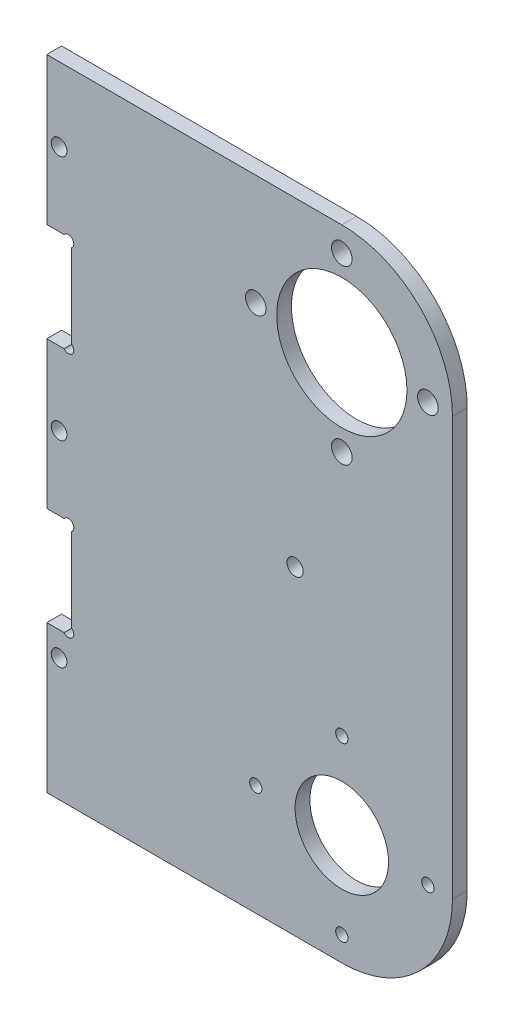
ISO-10303-21;
HEADER;
FILE_DESCRIPTION(('STEP AP214'),'2;1');
FILE_NAME('part.step','',(''),(''),'','','');
FILE_SCHEMA(('AUTOMOTIVE_DESIGN { 1 0 10303 214 1 1 1 1 }'));
ENDSEC;
DATA;
#1=APPLICATION_CONTEXT('core data for automotive mechanical design processes');
#2=APPLICATION_PROTOCOL_DEFINITION('international standard','automotive_design',2000,#1);
#3=PRODUCT_CONTEXT('',#1,'mechanical');
#4=PRODUCT('Part','Part','',(#3));
#5=PRODUCT_RELATED_PRODUCT_CATEGORY('part','',(#4));
#6=PRODUCT_DEFINITION_FORMATION('','',#4);
#7=PRODUCT_DEFINITION_CONTEXT('part definition',#1,'design');
#8=PRODUCT_DEFINITION('design','',#6,#7);
#9=PRODUCT_DEFINITION_SHAPE('','',#8);
#10=(LENGTH_UNIT() NAMED_UNIT(*) SI_UNIT(.MILLI.,.METRE.));
#11=(NAMED_UNIT(*) PLANE_ANGLE_UNIT() SI_UNIT($,.RADIAN.));
#12=(NAMED_UNIT(*) SI_UNIT($,.STERADIAN.) SOLID_ANGLE_UNIT());
#13=UNCERTAINTY_MEASURE_WITH_UNIT(LENGTH_MEASURE(1.E-05),#10,'distance_accuracy_value','');
#14=(GEOMETRIC_REPRESENTATION_CONTEXT(3) GLOBAL_UNCERTAINTY_ASSIGNED_CONTEXT((#13)) GLOBAL_UNIT_ASSIGNED_CONTEXT((#10,
#11,#12)) REPRESENTATION_CONTEXT('',''));
#15=CARTESIAN_POINT('',(0.,0.,0.));
#16=DIRECTION('',(0.,0.,1.));
#17=DIRECTION('',(1.,0.,0.));
#18=AXIS2_PLACEMENT_3D('',#15,#16,#17);
#19=CARTESIAN_POINT('',(-60.,0.,3.));
#20=DIRECTION('',(1.,0.,0.));
#21=DIRECTION('',(0.,1.,0.));
#22=AXIS2_PLACEMENT_3D('',#19,#20,#21);
#23=PLANE('',#22);
#24=DIRECTION('',(0.,0.,1.));
#25=VECTOR('',#24,1.);
#26=CARTESIAN_POINT('',(-60.,27.55,-7.));
#27=LINE('',#26,#25);
#28=CARTESIAN_POINT('',(-60.,27.55,0.));
#29=VERTEX_POINT('',#28);
#30=CARTESIAN_POINT('',(-60.,27.55,3.));
#31=VERTEX_POINT('',#30);
#32=EDGE_CURVE('E140',#29,#31,#27,.T.);
#33=ORIENTED_EDGE('',*,*,#32,.T.);
#34=DIRECTION('',(0.,-1.,0.));
#35=VECTOR('',#34,1.);
#36=CARTESIAN_POINT('',(-60.,0.,3.));
#37=LINE('',#36,#35);
#38=CARTESIAN_POINT('',(-60.,57.45,3.));
#39=VERTEX_POINT('',#38);
#40=EDGE_CURVE('E328',#39,#31,#37,.T.);
#41=ORIENTED_EDGE('',*,*,#40,.F.);
#42=DIRECTION('',(0.,0.,1.));
#43=VECTOR('',#42,1.);
#44=CARTESIAN_POINT('',(-60.,57.45,-7.));
#45=LINE('',#44,#43);
#46=CARTESIAN_POINT('',(-60.,57.45,0.));
#47=VERTEX_POINT('',#46);
#48=EDGE_CURVE('E301',#47,#39,#45,.T.);
#49=ORIENTED_EDGE('',*,*,#48,.F.);
#50=DIRECTION('',(0.,-1.,0.));
#51=VECTOR('',#50,1.);
#52=CARTESIAN_POINT('',(-60.,0.,0.));
#53=LINE('',#52,#51);
#54=EDGE_CURVE('E377',#47,#29,#53,.T.);
#55=ORIENTED_EDGE('',*,*,#54,.T.);
#56=EDGE_LOOP('',(#33,#41,#49,#55));
#57=FACE_BOUND('',#56,.T.);
#58=ADVANCED_FACE('F115',(#57),#23,.F.);
#59=DIRECTION('',(0.,0.,1.));
#60=VECTOR('',#59,1.);
#61=CARTESIAN_POINT('',(-60.,77.55,-7.));
#62=LINE('',#61,#60);
#63=CARTESIAN_POINT('',(-60.,77.55,0.));
#64=VERTEX_POINT('',#63);
#65=CARTESIAN_POINT('',(-60.,77.55,3.));
#66=VERTEX_POINT('',#65);
#67=EDGE_CURVE('E298',#64,#66,#62,.T.);
#68=ORIENTED_EDGE('',*,*,#67,.T.);
#69=CARTESIAN_POINT('',(-60.,107.5,3.));
#70=VERTEX_POINT('',#69);
#71=EDGE_CURVE('E324',#70,#66,#37,.T.);
#72=ORIENTED_EDGE('',*,*,#71,.F.);
#73=DIRECTION('',(0.,0.,-1.));
#74=VECTOR('',#73,1.);
#75=CARTESIAN_POINT('',(-60.,107.5,3.));
#76=LINE('',#75,#74);
#77=CARTESIAN_POINT('',(-60.,107.5,0.));
#78=VERTEX_POINT('',#77);
#79=EDGE_CURVE('E423',#70,#78,#76,.T.);
#80=ORIENTED_EDGE('',*,*,#79,.T.);
#81=EDGE_CURVE('E373',#78,#64,#53,.T.);
#82=ORIENTED_EDGE('',*,*,#81,.T.);
#83=EDGE_LOOP('',(#68,#72,#80,#82));
#84=FACE_BOUND('',#83,.T.);
#85=ADVANCED_FACE('F474',(#84),#23,.F.);
#86=CARTESIAN_POINT('',(0.,85.,3.));
#87=DIRECTION('',(0.,0.,-1.));
#88=DIRECTION('',(-1.,0.,0.));
#89=AXIS2_PLACEMENT_3D('',#86,#87,#88);
#90=CYLINDRICAL_SURFACE('',#89,22.5);
#91=CARTESIAN_POINT('',(0.,85.,0.));
#92=DIRECTION('',(0.,0.,1.));
#93=DIRECTION('',(1.,0.,0.));
#94=AXIS2_PLACEMENT_3D('',#91,#92,#93);
#95=CIRCLE('',#94,22.5);
#96=CARTESIAN_POINT('',(0.,107.5,0.));
#97=VERTEX_POINT('',#96);
#98=CARTESIAN_POINT('',(22.5,85.,0.));
#99=VERTEX_POINT('',#98);
#100=EDGE_CURVE('E365',#97,#99,#95,.F.);
#101=ORIENTED_EDGE('',*,*,#100,.F.);
#102=DIRECTION('',(0.,0.,-1.));
#103=VECTOR('',#102,1.);
#104=CARTESIAN_POINT('',(0.,107.5,3.));
#105=LINE('',#104,#103);
#106=CARTESIAN_POINT('',(0.,107.5,3.));
#107=VERTEX_POINT('',#106);
#108=EDGE_CURVE('E425',#107,#97,#105,.T.);
#109=ORIENTED_EDGE('',*,*,#108,.F.);
#110=CARTESIAN_POINT('',(0.,85.,3.));
#111=DIRECTION('',(0.,0.,1.));
#112=DIRECTION('',(1.,0.,0.));
#113=AXIS2_PLACEMENT_3D('',#110,#111,#112);
#114=CIRCLE('',#113,22.5);
#115=CARTESIAN_POINT('',(22.5,85.,3.));
#116=VERTEX_POINT('',#115);
#117=EDGE_CURVE('E316',#107,#116,#114,.F.);
#118=ORIENTED_EDGE('',*,*,#117,.T.);
#119=DIRECTION('',(0.,0.,-1.));
#120=VECTOR('',#119,1.);
#121=CARTESIAN_POINT('',(22.5,85.,3.));
#122=LINE('',#121,#120);
#123=EDGE_CURVE('E364',#116,#99,#122,.T.);
#124=ORIENTED_EDGE('',*,*,#123,.T.);
#125=EDGE_LOOP('',(#101,#109,#118,#124));
#126=FACE_BOUND('',#125,.T.);
#127=ADVANCED_FACE('F117',(#126),#90,.T.);
#128=CARTESIAN_POINT('',(0.,107.5,3.));
#129=DIRECTION('',(0.,1.,0.));
#130=DIRECTION('',(0.,0.,1.));
#131=AXIS2_PLACEMENT_3D('',#128,#129,#130);
#132=PLANE('',#131);
#133=DIRECTION('',(1.,0.,0.));
#134=VECTOR('',#133,1.);
#135=CARTESIAN_POINT('',(0.,107.5,0.));
#136=LINE('',#135,#134);
#137=EDGE_CURVE('E368',#78,#97,#136,.T.);
#138=ORIENTED_EDGE('',*,*,#137,.F.);
#139=ORIENTED_EDGE('',*,*,#79,.F.);
#140=DIRECTION('',(1.,0.,0.));
#141=VECTOR('',#140,1.);
#142=CARTESIAN_POINT('',(0.,107.5,3.));
#143=LINE('',#142,#141);
#144=EDGE_CURVE('E319',#70,#107,#143,.T.);
#145=ORIENTED_EDGE('',*,*,#144,.T.);
#146=ORIENTED_EDGE('',*,*,#108,.T.);
#147=EDGE_LOOP('',(#138,#139,#145,#146));
#148=FACE_BOUND('',#147,.T.);
#149=ADVANCED_FACE('F486',(#148),#132,.T.);
#150=CARTESIAN_POINT('',(-60.,7.44999999999999,3.));
#151=VERTEX_POINT('',#150);
#152=CARTESIAN_POINT('',(-60.,-22.5,3.));
#153=VERTEX_POINT('',#152);
#154=EDGE_CURVE('E323',#151,#153,#37,.T.);
#155=ORIENTED_EDGE('',*,*,#154,.F.);
#156=DIRECTION('',(0.,0.,1.));
#157=VECTOR('',#156,1.);
#158=CARTESIAN_POINT('',(-60.,7.44999999999999,-7.));
#159=LINE('',#158,#157);
#160=CARTESIAN_POINT('',(-60.,7.44999999999999,0.));
#161=VERTEX_POINT('',#160);
#162=EDGE_CURVE('E251',#161,#151,#159,.T.);
#163=ORIENTED_EDGE('',*,*,#162,.F.);
#164=CARTESIAN_POINT('',(-60.,-22.5,0.));
#165=VERTEX_POINT('',#164);
#166=EDGE_CURVE('E372',#161,#165,#53,.T.);
#167=ORIENTED_EDGE('',*,*,#166,.T.);
#168=DIRECTION('',(0.,0.,-1.));
#169=VECTOR('',#168,1.);
#170=CARTESIAN_POINT('',(-60.,-22.5,3.));
#171=LINE('',#170,#169);
#172=EDGE_CURVE('E420',#153,#165,#171,.T.);
#173=ORIENTED_EDGE('',*,*,#172,.F.);
#174=EDGE_LOOP('',(#155,#163,#167,#173));
#175=FACE_BOUND('',#174,.T.);
#176=ADVANCED_FACE('F477',(#175),#23,.F.);
#177=CARTESIAN_POINT('',(0.,-22.5,3.));
#178=DIRECTION('',(0.,1.,0.));
#179=DIRECTION('',(0.,0.,1.));
#180=AXIS2_PLACEMENT_3D('',#177,#178,#179);
#181=PLANE('',#180);
#182=DIRECTION('',(1.,0.,0.));
#183=VECTOR('',#182,1.);
#184=CARTESIAN_POINT('',(0.,-22.5,0.));
#185=LINE('',#184,#183);
#186=CARTESIAN_POINT('',(0.,-22.5,0.));
#187=VERTEX_POINT('',#186);
#188=EDGE_CURVE('E376',#165,#187,#185,.T.);
#189=ORIENTED_EDGE('',*,*,#188,.T.);
#190=DIRECTION('',(0.,0.,-1.));
#191=VECTOR('',#190,1.);
#192=CARTESIAN_POINT('',(0.,-22.5,3.));
#193=LINE('',#192,#191);
#194=CARTESIAN_POINT('',(0.,-22.5,3.));
#195=VERTEX_POINT('',#194);
#196=EDGE_CURVE('E417',#195,#187,#193,.T.);
#197=ORIENTED_EDGE('',*,*,#196,.F.);
#198=DIRECTION('',(1.,0.,0.));
#199=VECTOR('',#198,1.);
#200=CARTESIAN_POINT('',(0.,-22.5,3.));
#201=LINE('',#200,#199);
#202=EDGE_CURVE('E327',#153,#195,#201,.T.);
#203=ORIENTED_EDGE('',*,*,#202,.F.);
#204=ORIENTED_EDGE('',*,*,#172,.T.);
#205=EDGE_LOOP('',(#189,#197,#203,#204));
#206=FACE_BOUND('',#205,.T.);
#207=ADVANCED_FACE('F485',(#206),#181,.F.);
#208=CARTESIAN_POINT('',(0.,0.,3.));
#209=DIRECTION('',(0.,0.,-1.));
#210=DIRECTION('',(-1.,0.,0.));
#211=AXIS2_PLACEMENT_3D('',#208,#209,#210);
#212=CYLINDRICAL_SURFACE('',#211,22.5);
#213=CARTESIAN_POINT('',(0.,0.,0.));
#214=DIRECTION('',(0.,0.,1.));
#215=DIRECTION('',(1.,0.,0.));
#216=AXIS2_PLACEMENT_3D('',#213,#214,#215);
#217=CIRCLE('',#216,22.5);
#218=CARTESIAN_POINT('',(22.5,0.,0.));
#219=VERTEX_POINT('',#218);
#220=EDGE_CURVE('E379',#187,#219,#217,.T.);
#221=ORIENTED_EDGE('',*,*,#220,.T.);
#222=DIRECTION('',(0.,0.,-1.));
#223=VECTOR('',#222,1.);
#224=CARTESIAN_POINT('',(22.5,0.,3.));
#225=LINE('',#224,#223);
#226=CARTESIAN_POINT('',(22.5,0.,3.));
#227=VERTEX_POINT('',#226);
#228=EDGE_CURVE('E414',#227,#219,#225,.T.);
#229=ORIENTED_EDGE('',*,*,#228,.F.);
#230=CARTESIAN_POINT('',(0.,0.,3.));
#231=DIRECTION('',(0.,0.,1.));
#232=DIRECTION('',(1.,0.,0.));
#233=AXIS2_PLACEMENT_3D('',#230,#231,#232);
#234=CIRCLE('',#233,22.5);
#235=EDGE_CURVE('E330',#195,#227,#234,.T.);
#236=ORIENTED_EDGE('',*,*,#235,.F.);
#237=ORIENTED_EDGE('',*,*,#196,.T.);
#238=EDGE_LOOP('',(#221,#229,#236,#237));
#239=FACE_BOUND('',#238,.T.);
#240=ADVANCED_FACE('F492',(#239),#212,.T.);
#241=CARTESIAN_POINT('',(0.,17.5,3.));
#242=DIRECTION('',(0.,0.,-1.));
#243=DIRECTION('',(-1.,0.,0.));
#244=AXIS2_PLACEMENT_3D('',#241,#242,#243);
#245=CYLINDRICAL_SURFACE('',#244,1.25);
#246=CARTESIAN_POINT('',(0.,17.5,3.));
#247=DIRECTION('',(0.,0.,1.));
#248=DIRECTION('',(1.,0.,0.));
#249=AXIS2_PLACEMENT_3D('',#246,#247,#248);
#250=CIRCLE('',#249,1.25);
#251=CARTESIAN_POINT('',(1.25000000000005,17.5,3.));
#252=VERTEX_POINT('',#251);
#253=EDGE_CURVE('E358',#252,#252,#250,.T.);
#254=ORIENTED_EDGE('',*,*,#253,.T.);
#255=EDGE_LOOP('',(#254));
#256=FACE_BOUND('',#255,.T.);
#257=CARTESIAN_POINT('',(0.,17.5,0.));
#258=DIRECTION('',(0.,0.,1.));
#259=DIRECTION('',(1.,0.,0.));
#260=AXIS2_PLACEMENT_3D('',#257,#258,#259);
#261=CIRCLE('',#260,1.25);
#262=CARTESIAN_POINT('',(1.25000000000005,17.5,0.));
#263=VERTEX_POINT('',#262);
#264=EDGE_CURVE('E408',#263,#263,#261,.T.);
#265=ORIENTED_EDGE('',*,*,#264,.F.);
#266=EDGE_LOOP('',(#265));
#267=FACE_BOUND('',#266,.T.);
#268=ADVANCED_FACE('F562',(#256,#267),#245,.F.);
#269=CARTESIAN_POINT('',(17.5,0.,3.));
#270=DIRECTION('',(0.,0.,-1.));
#271=DIRECTION('',(-1.,0.,0.));
#272=AXIS2_PLACEMENT_3D('',#269,#270,#271);
#273=CYLINDRICAL_SURFACE('',#272,1.25);
#274=CARTESIAN_POINT('',(17.5,0.,3.));
#275=DIRECTION('',(0.,0.,1.));
#276=DIRECTION('',(1.,0.,0.));
#277=AXIS2_PLACEMENT_3D('',#274,#275,#276);
#278=CIRCLE('',#277,1.25);
#279=CARTESIAN_POINT('',(18.75,0.,3.));
#280=VERTEX_POINT('',#279);
#281=EDGE_CURVE('E355',#280,#280,#278,.T.);
#282=ORIENTED_EDGE('',*,*,#281,.T.);
#283=EDGE_LOOP('',(#282));
#284=FACE_BOUND('',#283,.T.);
#285=CARTESIAN_POINT('',(17.5,0.,0.));
#286=DIRECTION('',(0.,0.,1.));
#287=DIRECTION('',(1.,0.,0.));
#288=AXIS2_PLACEMENT_3D('',#285,#286,#287);
#289=CIRCLE('',#288,1.25);
#290=CARTESIAN_POINT('',(18.75,0.,0.));
#291=VERTEX_POINT('',#290);
#292=EDGE_CURVE('E405',#291,#291,#289,.T.);
#293=ORIENTED_EDGE('',*,*,#292,.F.);
#294=EDGE_LOOP('',(#293));
#295=FACE_BOUND('',#294,.T.);
#296=ADVANCED_FACE('F570',(#284,#295),#273,.F.);
#297=CARTESIAN_POINT('',(0.,-17.5,3.));
#298=DIRECTION('',(0.,0.,-1.));
#299=DIRECTION('',(-1.,0.,0.));
#300=AXIS2_PLACEMENT_3D('',#297,#298,#299);
#301=CYLINDRICAL_SURFACE('',#300,1.25);
#302=CARTESIAN_POINT('',(0.,-17.5,3.));
#303=DIRECTION('',(0.,0.,1.));
#304=DIRECTION('',(1.,0.,0.));
#305=AXIS2_PLACEMENT_3D('',#302,#303,#304);
#306=CIRCLE('',#305,1.25);
#307=CARTESIAN_POINT('',(1.24999999999994,-17.5,3.));
#308=VERTEX_POINT('',#307);
#309=EDGE_CURVE('E352',#308,#308,#306,.T.);
#310=ORIENTED_EDGE('',*,*,#309,.T.);
#311=EDGE_LOOP('',(#310));
#312=FACE_BOUND('',#311,.T.);
#313=CARTESIAN_POINT('',(0.,-17.5,0.));
#314=DIRECTION('',(0.,0.,1.));
#315=DIRECTION('',(1.,0.,0.));
#316=AXIS2_PLACEMENT_3D('',#313,#314,#315);
#317=CIRCLE('',#316,1.25);
#318=CARTESIAN_POINT('',(1.24999999999994,-17.5,0.));
#319=VERTEX_POINT('',#318);
#320=EDGE_CURVE('E402',#319,#319,#317,.T.);
#321=ORIENTED_EDGE('',*,*,#320,.F.);
#322=EDGE_LOOP('',(#321));
#323=FACE_BOUND('',#322,.T.);
#324=ADVANCED_FACE('F579',(#312,#323),#301,.F.);
#325=CARTESIAN_POINT('',(-17.5,0.,3.));
#326=DIRECTION('',(0.,0.,-1.));
#327=DIRECTION('',(-1.,0.,0.));
#328=AXIS2_PLACEMENT_3D('',#325,#326,#327);
#329=CYLINDRICAL_SURFACE('',#328,1.25);
#330=CARTESIAN_POINT('',(-17.5,0.,3.));
#331=DIRECTION('',(0.,0.,1.));
#332=DIRECTION('',(1.,0.,0.));
#333=AXIS2_PLACEMENT_3D('',#330,#331,#332);
#334=CIRCLE('',#333,1.25);
#335=CARTESIAN_POINT('',(-16.25,0.,3.));
#336=VERTEX_POINT('',#335);
#337=EDGE_CURVE('E349',#336,#336,#334,.T.);
#338=ORIENTED_EDGE('',*,*,#337,.T.);
#339=EDGE_LOOP('',(#338));
#340=FACE_BOUND('',#339,.T.);
#341=CARTESIAN_POINT('',(-17.5,0.,0.));
#342=DIRECTION('',(0.,0.,1.));
#343=DIRECTION('',(1.,0.,0.));
#344=AXIS2_PLACEMENT_3D('',#341,#342,#343);
#345=CIRCLE('',#344,1.25);
#346=CARTESIAN_POINT('',(-16.25,0.,0.));
#347=VERTEX_POINT('',#346);
#348=EDGE_CURVE('E399',#347,#347,#345,.T.);
#349=ORIENTED_EDGE('',*,*,#348,.F.);
#350=EDGE_LOOP('',(#349));
#351=FACE_BOUND('',#350,.T.);
#352=ADVANCED_FACE('F588',(#340,#351),#329,.F.);
#353=CARTESIAN_POINT('',(0.,85.,3.));
#354=DIRECTION('',(0.,0.,-1.));
#355=DIRECTION('',(-1.,0.,0.));
#356=AXIS2_PLACEMENT_3D('',#353,#354,#355);
#357=CYLINDRICAL_SURFACE('',#356,13.25);
#358=CARTESIAN_POINT('',(0.,85.,3.));
#359=DIRECTION('',(0.,0.,1.));
#360=DIRECTION('',(1.,0.,0.));
#361=AXIS2_PLACEMENT_3D('',#358,#359,#360);
#362=CIRCLE('',#361,13.25);
#363=CARTESIAN_POINT('',(13.25,85.,3.));
#364=VERTEX_POINT('',#363);
#365=EDGE_CURVE('E346',#364,#364,#362,.T.);
#366=ORIENTED_EDGE('',*,*,#365,.T.);
#367=EDGE_LOOP('',(#366));
#368=FACE_BOUND('',#367,.T.);
#369=CARTESIAN_POINT('',(0.,85.,0.));
#370=DIRECTION('',(0.,0.,1.));
#371=DIRECTION('',(1.,0.,0.));
#372=AXIS2_PLACEMENT_3D('',#369,#370,#371);
#373=CIRCLE('',#372,13.25);
#374=CARTESIAN_POINT('',(13.25,85.,0.));
#375=VERTEX_POINT('',#374);
#376=EDGE_CURVE('E396',#375,#375,#373,.T.);
#377=ORIENTED_EDGE('',*,*,#376,.F.);
#378=EDGE_LOOP('',(#377));
#379=FACE_BOUND('',#378,.T.);
#380=ADVANCED_FACE('F597',(#368,#379),#357,.F.);
#381=CARTESIAN_POINT('',(0.,67.5,3.));
#382=DIRECTION('',(0.,0.,-1.));
#383=DIRECTION('',(-1.,0.,0.));
#384=AXIS2_PLACEMENT_3D('',#381,#382,#383);
#385=CYLINDRICAL_SURFACE('',#384,2.1);
#386=CARTESIAN_POINT('',(0.,67.5,3.));
#387=DIRECTION('',(0.,0.,1.));
#388=DIRECTION('',(1.,0.,0.));
#389=AXIS2_PLACEMENT_3D('',#386,#387,#388);
#390=CIRCLE('',#389,2.1);
#391=CARTESIAN_POINT('',(2.10000000000005,67.5,3.));
#392=VERTEX_POINT('',#391);
#393=EDGE_CURVE('E343',#392,#392,#390,.T.);
#394=ORIENTED_EDGE('',*,*,#393,.T.);
#395=EDGE_LOOP('',(#394));
#396=FACE_BOUND('',#395,.T.);
#397=CARTESIAN_POINT('',(0.,67.5,0.));
#398=DIRECTION('',(0.,0.,1.));
#399=DIRECTION('',(1.,0.,0.));
#400=AXIS2_PLACEMENT_3D('',#397,#398,#399);
#401=CIRCLE('',#400,2.1);
#402=CARTESIAN_POINT('',(2.10000000000005,67.5,0.));
#403=VERTEX_POINT('',#402);
#404=EDGE_CURVE('E393',#403,#403,#401,.T.);
#405=ORIENTED_EDGE('',*,*,#404,.F.);
#406=EDGE_LOOP('',(#405));
#407=FACE_BOUND('',#406,.T.);
#408=ADVANCED_FACE('F606',(#396,#407),#385,.F.);
#409=CARTESIAN_POINT('',(-17.5,85.,3.));
#410=DIRECTION('',(0.,0.,-1.));
#411=DIRECTION('',(-1.,0.,0.));
#412=AXIS2_PLACEMENT_3D('',#409,#410,#411);
#413=CYLINDRICAL_SURFACE('',#412,2.1);
#414=CARTESIAN_POINT('',(-17.5,85.,3.));
#415=DIRECTION('',(0.,0.,1.));
#416=DIRECTION('',(1.,0.,0.));
#417=AXIS2_PLACEMENT_3D('',#414,#415,#416);
#418=CIRCLE('',#417,2.1);
#419=CARTESIAN_POINT('',(-15.4,85.,3.));
#420=VERTEX_POINT('',#419);
#421=EDGE_CURVE('E340',#420,#420,#418,.T.);
#422=ORIENTED_EDGE('',*,*,#421,.T.);
#423=EDGE_LOOP('',(#422));
#424=FACE_BOUND('',#423,.T.);
#425=CARTESIAN_POINT('',(-17.5,85.,0.));
#426=DIRECTION('',(0.,0.,1.));
#427=DIRECTION('',(1.,0.,0.));
#428=AXIS2_PLACEMENT_3D('',#425,#426,#427);
#429=CIRCLE('',#428,2.1);
#430=CARTESIAN_POINT('',(-15.4,85.,0.));
#431=VERTEX_POINT('',#430);
#432=EDGE_CURVE('E390',#431,#431,#429,.T.);
#433=ORIENTED_EDGE('',*,*,#432,.F.);
#434=EDGE_LOOP('',(#433));
#435=FACE_BOUND('',#434,.T.);
#436=ADVANCED_FACE('F615',(#424,#435),#413,.F.);
#437=CARTESIAN_POINT('',(0.,102.5,3.));
#438=DIRECTION('',(0.,0.,-1.));
#439=DIRECTION('',(-1.,0.,0.));
#440=AXIS2_PLACEMENT_3D('',#437,#438,#439);
#441=CYLINDRICAL_SURFACE('',#440,2.1);
#442=CARTESIAN_POINT('',(0.,102.5,3.));
#443=DIRECTION('',(0.,0.,1.));
#444=DIRECTION('',(1.,0.,0.));
#445=AXIS2_PLACEMENT_3D('',#442,#443,#444);
#446=CIRCLE('',#445,2.1);
#447=CARTESIAN_POINT('',(2.10000000000004,102.5,3.));
#448=VERTEX_POINT('',#447);
#449=EDGE_CURVE('E337',#448,#448,#446,.T.);
#450=ORIENTED_EDGE('',*,*,#449,.T.);
#451=EDGE_LOOP('',(#450));
#452=FACE_BOUND('',#451,.T.);
#453=CARTESIAN_POINT('',(0.,102.5,0.));
#454=DIRECTION('',(0.,0.,1.));
#455=DIRECTION('',(1.,0.,0.));
#456=AXIS2_PLACEMENT_3D('',#453,#454,#455);
#457=CIRCLE('',#456,2.1);
#458=CARTESIAN_POINT('',(2.10000000000004,102.5,0.));
#459=VERTEX_POINT('',#458);
#460=EDGE_CURVE('E387',#459,#459,#457,.T.);
#461=ORIENTED_EDGE('',*,*,#460,.F.);
#462=EDGE_LOOP('',(#461));
#463=FACE_BOUND('',#462,.T.);
#464=ADVANCED_FACE('F624',(#452,#463),#441,.F.);
#465=CARTESIAN_POINT('',(17.5000000000001,85.,3.));
#466=DIRECTION('',(0.,0.,-1.));
#467=DIRECTION('',(-1.,0.,0.));
#468=AXIS2_PLACEMENT_3D('',#465,#466,#467);
#469=CYLINDRICAL_SURFACE('',#468,2.1);
#470=CARTESIAN_POINT('',(17.5000000000001,85.,3.));
#471=DIRECTION('',(0.,0.,1.));
#472=DIRECTION('',(1.,0.,0.));
#473=AXIS2_PLACEMENT_3D('',#470,#471,#472);
#474=CIRCLE('',#473,2.1);
#475=CARTESIAN_POINT('',(19.6000000000001,85.,3.));
#476=VERTEX_POINT('',#475);
#477=EDGE_CURVE('E334',#476,#476,#474,.T.);
#478=ORIENTED_EDGE('',*,*,#477,.T.);
#479=EDGE_LOOP('',(#478));
#480=FACE_BOUND('',#479,.T.);
#481=CARTESIAN_POINT('',(17.5000000000001,85.,0.));
#482=DIRECTION('',(0.,0.,1.));
#483=DIRECTION('',(1.,0.,0.));
#484=AXIS2_PLACEMENT_3D('',#481,#482,#483);
#485=CIRCLE('',#484,2.1);
#486=CARTESIAN_POINT('',(19.6000000000001,85.,0.));
#487=VERTEX_POINT('',#486);
#488=EDGE_CURVE('E384',#487,#487,#485,.T.);
#489=ORIENTED_EDGE('',*,*,#488,.F.);
#490=EDGE_LOOP('',(#489));
#491=FACE_BOUND('',#490,.T.);
#492=ADVANCED_FACE('F633',(#480,#491),#469,.F.);
#493=CARTESIAN_POINT('',(22.5,0.,3.));
#494=DIRECTION('',(-1.,0.,0.));
#495=DIRECTION('',(0.,0.,1.));
#496=AXIS2_PLACEMENT_3D('',#493,#494,#495);
#497=PLANE('',#496);
#498=DIRECTION('',(0.,1.,0.));
#499=VECTOR('',#498,1.);
#500=CARTESIAN_POINT('',(22.5,0.,0.));
#501=LINE('',#500,#499);
#502=EDGE_CURVE('E381',#219,#99,#501,.T.);
#503=ORIENTED_EDGE('',*,*,#502,.T.);
#504=ORIENTED_EDGE('',*,*,#123,.F.);
#505=DIRECTION('',(0.,1.,0.));
#506=VECTOR('',#505,1.);
#507=CARTESIAN_POINT('',(22.5,0.,3.));
#508=LINE('',#507,#506);
#509=EDGE_CURVE('E332',#227,#116,#508,.T.);
#510=ORIENTED_EDGE('',*,*,#509,.F.);
#511=ORIENTED_EDGE('',*,*,#228,.T.);
#512=EDGE_LOOP('',(#503,#504,#510,#511));
#513=FACE_BOUND('',#512,.T.);
#514=ADVANCED_FACE('F517',(#513),#497,.F.);
#515=CARTESIAN_POINT('',(0.,0.,3.));
#516=DIRECTION('',(0.,0.,-1.));
#517=DIRECTION('',(-1.,0.,0.));
#518=AXIS2_PLACEMENT_3D('',#515,#516,#517);
#519=CYLINDRICAL_SURFACE('',#518,9.5);
#520=CARTESIAN_POINT('',(0.,0.,3.));
#521=DIRECTION('',(0.,0.,1.));
#522=DIRECTION('',(1.,0.,0.));
#523=AXIS2_PLACEMENT_3D('',#520,#521,#522);
#524=CIRCLE('',#523,9.5);
#525=CARTESIAN_POINT('',(9.5,0.,3.));
#526=VERTEX_POINT('',#525);
#527=EDGE_CURVE('E361',#526,#526,#524,.T.);
#528=ORIENTED_EDGE('',*,*,#527,.T.);
#529=EDGE_LOOP('',(#528));
#530=FACE_BOUND('',#529,.T.);
#531=CARTESIAN_POINT('',(0.,0.,0.));
#532=DIRECTION('',(0.,0.,1.));
#533=DIRECTION('',(1.,0.,0.));
#534=AXIS2_PLACEMENT_3D('',#531,#532,#533);
#535=CIRCLE('',#534,9.5);
#536=CARTESIAN_POINT('',(9.5,0.,0.));
#537=VERTEX_POINT('',#536);
#538=EDGE_CURVE('E320',#537,#537,#535,.T.);
#539=ORIENTED_EDGE('',*,*,#538,.F.);
#540=EDGE_LOOP('',(#539));
#541=FACE_BOUND('',#540,.T.);
#542=ADVANCED_FACE('F649',(#530,#541),#519,.F.);
#543=CARTESIAN_POINT('',(0.,0.,3.));
#544=DIRECTION('',(0.,0.,1.));
#545=DIRECTION('',(1.,0.,0.));
#546=AXIS2_PLACEMENT_3D('',#543,#544,#545);
#547=PLANE('',#546);
#548=CARTESIAN_POINT('',(-9.50000000000001,42.5,3.));
#549=DIRECTION('',(0.,0.,1.));
#550=DIRECTION('',(1.,0.,0.));
#551=AXIS2_PLACEMENT_3D('',#548,#549,#550);
#552=CIRCLE('',#551,1.65);
#553=CARTESIAN_POINT('',(-7.85,42.5,3.));
#554=VERTEX_POINT('',#553);
#555=EDGE_CURVE('E809',#554,#554,#552,.T.);
#556=ORIENTED_EDGE('',*,*,#555,.F.);
#557=EDGE_LOOP('',(#556));
#558=FACE_BOUND('',#557,.T.);
#559=CARTESIAN_POINT('',(-57.5,92.5,3.));
#560=DIRECTION('',(0.,0.,1.));
#561=DIRECTION('',(1.,0.,0.));
#562=AXIS2_PLACEMENT_3D('',#559,#560,#561);
#563=CIRCLE('',#562,1.6);
#564=CARTESIAN_POINT('',(-55.9,92.5,3.));
#565=VERTEX_POINT('',#564);
#566=EDGE_CURVE('E267',#565,#565,#563,.T.);
#567=ORIENTED_EDGE('',*,*,#566,.F.);
#568=EDGE_LOOP('',(#567));
#569=FACE_BOUND('',#568,.T.);
#570=DIRECTION('',(1.,0.,0.));
#571=VECTOR('',#570,1.);
#572=CARTESIAN_POINT('',(-60.,7.44999999999999,3.));
#573=LINE('',#572,#571);
#574=CARTESIAN_POINT('',(-56.4899999999999,7.45000000000001,3.));
#575=VERTEX_POINT('',#574);
#576=EDGE_CURVE('E255',#151,#575,#573,.T.);
#577=ORIENTED_EDGE('',*,*,#576,.F.);
#578=ORIENTED_EDGE('',*,*,#154,.T.);
#579=ORIENTED_EDGE('',*,*,#202,.T.);
#580=ORIENTED_EDGE('',*,*,#235,.T.);
#581=ORIENTED_EDGE('',*,*,#509,.T.);
#582=ORIENTED_EDGE('',*,*,#117,.F.);
#583=ORIENTED_EDGE('',*,*,#144,.F.);
#584=ORIENTED_EDGE('',*,*,#71,.T.);
#585=DIRECTION('',(1.,0.,0.));
#586=VECTOR('',#585,1.);
#587=CARTESIAN_POINT('',(2.13113355345744E-13,77.5499999999998,3.));
#588=LINE('',#587,#586);
#589=CARTESIAN_POINT('',(-56.4900000000003,77.55,3.));
#590=VERTEX_POINT('',#589);
#591=EDGE_CURVE('E295',#66,#590,#588,.T.);
#592=ORIENTED_EDGE('',*,*,#591,.T.);
#593=CARTESIAN_POINT('',(-55.6100000000002,76.89,3.));
#594=DIRECTION('',(0.,0.,1.));
#595=DIRECTION('',(1.,0.,0.));
#596=AXIS2_PLACEMENT_3D('',#593,#594,#595);
#597=CIRCLE('',#596,1.10000000000001);
#598=CARTESIAN_POINT('',(-54.95,76.0100000000001,3.));
#599=VERTEX_POINT('',#598);
#600=EDGE_CURVE('E293',#599,#590,#597,.T.);
#601=ORIENTED_EDGE('',*,*,#600,.F.);
#602=DIRECTION('',(0.,-1.,0.));
#603=VECTOR('',#602,1.);
#604=CARTESIAN_POINT('',(-54.95,0.,3.));
#605=LINE('',#604,#603);
#606=CARTESIAN_POINT('',(-54.95,58.9899999999999,3.));
#607=VERTEX_POINT('',#606);
#608=EDGE_CURVE('E297',#599,#607,#605,.T.);
#609=ORIENTED_EDGE('',*,*,#608,.T.);
#610=CARTESIAN_POINT('',(-55.6100000000001,58.11,3.));
#611=DIRECTION('',(0.,0.,1.));
#612=DIRECTION('',(1.,0.,0.));
#613=AXIS2_PLACEMENT_3D('',#610,#611,#612);
#614=CIRCLE('',#613,1.10000000000001);
#615=CARTESIAN_POINT('',(-56.4900000000001,57.45,3.));
#616=VERTEX_POINT('',#615);
#617=EDGE_CURVE('E290',#616,#607,#614,.T.);
#618=ORIENTED_EDGE('',*,*,#617,.F.);
#619=DIRECTION('',(1.,0.,0.));
#620=VECTOR('',#619,1.);
#621=CARTESIAN_POINT('',(0.,57.4499999999999,3.));
#622=LINE('',#621,#620);
#623=EDGE_CURVE('E311',#39,#616,#622,.T.);
#624=ORIENTED_EDGE('',*,*,#623,.F.);
#625=ORIENTED_EDGE('',*,*,#40,.T.);
#626=DIRECTION('',(1.,0.,0.));
#627=VECTOR('',#626,1.);
#628=CARTESIAN_POINT('',(-60.,27.55,3.));
#629=LINE('',#628,#627);
#630=CARTESIAN_POINT('',(-56.4900000000001,27.55,3.));
#631=VERTEX_POINT('',#630);
#632=EDGE_CURVE('E261',#31,#631,#629,.T.);
#633=ORIENTED_EDGE('',*,*,#632,.T.);
#634=CARTESIAN_POINT('',(-55.6100000000001,26.89,3.));
#635=DIRECTION('',(0.,0.,1.));
#636=DIRECTION('',(1.,0.,0.));
#637=AXIS2_PLACEMENT_3D('',#634,#635,#636);
#638=CIRCLE('',#637,1.1);
#639=CARTESIAN_POINT('',(-54.9500000000001,26.01,3.));
#640=VERTEX_POINT('',#639);
#641=EDGE_CURVE('E279',#640,#631,#638,.T.);
#642=ORIENTED_EDGE('',*,*,#641,.F.);
#643=DIRECTION('',(0.,-1.,0.));
#644=VECTOR('',#643,1.);
#645=CARTESIAN_POINT('',(-54.9500000000001,27.55,3.));
#646=LINE('',#645,#644);
#647=CARTESIAN_POINT('',(-54.95,8.98999999999994,3.));
#648=VERTEX_POINT('',#647);
#649=EDGE_CURVE('E260',#640,#648,#646,.T.);
#650=ORIENTED_EDGE('',*,*,#649,.T.);
#651=CARTESIAN_POINT('',(-55.61,8.11000000000002,3.));
#652=DIRECTION('',(0.,0.,1.));
#653=DIRECTION('',(1.,0.,0.));
#654=AXIS2_PLACEMENT_3D('',#651,#652,#653);
#655=CIRCLE('',#654,1.09999999999993);
#656=EDGE_CURVE('E247',#575,#648,#655,.T.);
#657=ORIENTED_EDGE('',*,*,#656,.F.);
#658=EDGE_LOOP('',(#577,#578,#579,#580,#581,#582,#583,#584,#592,#601,#609,#618,#624,#625,#633,
#642,#650,#657));
#659=FACE_BOUND('',#658,.T.);
#660=CARTESIAN_POINT('',(-57.5,2.5,3.));
#661=DIRECTION('',(0.,0.,1.));
#662=DIRECTION('',(1.,0.,0.));
#663=AXIS2_PLACEMENT_3D('',#660,#661,#662);
#664=CIRCLE('',#663,1.6);
#665=CARTESIAN_POINT('',(-55.9,2.5,3.));
#666=VERTEX_POINT('',#665);
#667=EDGE_CURVE('E283',#666,#666,#664,.T.);
#668=ORIENTED_EDGE('',*,*,#667,.F.);
#669=EDGE_LOOP('',(#668));
#670=FACE_BOUND('',#669,.T.);
#671=CARTESIAN_POINT('',(-57.5,42.5,3.));
#672=DIRECTION('',(0.,0.,1.));
#673=DIRECTION('',(1.,0.,0.));
#674=AXIS2_PLACEMENT_3D('',#671,#672,#673);
#675=CIRCLE('',#674,1.6);
#676=CARTESIAN_POINT('',(-55.9,42.5,3.));
#677=VERTEX_POINT('',#676);
#678=EDGE_CURVE('E287',#677,#677,#675,.T.);
#679=ORIENTED_EDGE('',*,*,#678,.F.);
#680=EDGE_LOOP('',(#679));
#681=FACE_BOUND('',#680,.T.);
#682=ORIENTED_EDGE('',*,*,#477,.F.);
#683=EDGE_LOOP('',(#682));
#684=FACE_BOUND('',#683,.T.);
#685=ORIENTED_EDGE('',*,*,#449,.F.);
#686=EDGE_LOOP('',(#685));
#687=FACE_BOUND('',#686,.T.);
#688=ORIENTED_EDGE('',*,*,#421,.F.);
#689=EDGE_LOOP('',(#688));
#690=FACE_BOUND('',#689,.T.);
#691=ORIENTED_EDGE('',*,*,#393,.F.);
#692=EDGE_LOOP('',(#691));
#693=FACE_BOUND('',#692,.T.);
#694=ORIENTED_EDGE('',*,*,#365,.F.);
#695=EDGE_LOOP('',(#694));
#696=FACE_BOUND('',#695,.T.);
#697=ORIENTED_EDGE('',*,*,#337,.F.);
#698=EDGE_LOOP('',(#697));
#699=FACE_BOUND('',#698,.T.);
#700=ORIENTED_EDGE('',*,*,#309,.F.);
#701=EDGE_LOOP('',(#700));
#702=FACE_BOUND('',#701,.T.);
#703=ORIENTED_EDGE('',*,*,#281,.F.);
#704=EDGE_LOOP('',(#703));
#705=FACE_BOUND('',#704,.T.);
#706=ORIENTED_EDGE('',*,*,#253,.F.);
#707=EDGE_LOOP('',(#706));
#708=FACE_BOUND('',#707,.T.);
#709=ORIENTED_EDGE('',*,*,#527,.F.);
#710=EDGE_LOOP('',(#709));
#711=FACE_BOUND('',#710,.T.);
#712=ADVANCED_FACE('F263',(#558,#569,#659,#670,#681,#684,#687,#690,#693,#696,#699,#702,#705,
#708,#711),#547,.T.);
#713=CARTESIAN_POINT('',(0.,0.,0.));
#714=DIRECTION('',(0.,0.,1.));
#715=DIRECTION('',(1.,0.,0.));
#716=AXIS2_PLACEMENT_3D('',#713,#714,#715);
#717=PLANE('',#716);
#718=CARTESIAN_POINT('',(-9.50000000000001,42.5,0.));
#719=DIRECTION('',(0.,0.,1.));
#720=DIRECTION('',(1.,0.,0.));
#721=AXIS2_PLACEMENT_3D('',#718,#719,#720);
#722=CIRCLE('',#721,1.65);
#723=CARTESIAN_POINT('',(-7.85,42.5,0.));
#724=VERTEX_POINT('',#723);
#725=EDGE_CURVE('E119',#724,#724,#722,.T.);
#726=ORIENTED_EDGE('',*,*,#725,.T.);
#727=EDGE_LOOP('',(#726));
#728=FACE_BOUND('',#727,.T.);
#729=CARTESIAN_POINT('',(-57.5,92.5,0.));
#730=DIRECTION('',(0.,0.,1.));
#731=DIRECTION('',(1.,0.,0.));
#732=AXIS2_PLACEMENT_3D('',#729,#730,#731);
#733=CIRCLE('',#732,1.6);
#734=CARTESIAN_POINT('',(-55.9,92.5,0.));
#735=VERTEX_POINT('',#734);
#736=EDGE_CURVE('E369',#735,#735,#733,.T.);
#737=ORIENTED_EDGE('',*,*,#736,.T.);
#738=EDGE_LOOP('',(#737));
#739=FACE_BOUND('',#738,.T.);
#740=CARTESIAN_POINT('',(-57.5,2.5,0.));
#741=DIRECTION('',(0.,0.,1.));
#742=DIRECTION('',(1.,0.,0.));
#743=AXIS2_PLACEMENT_3D('',#740,#741,#742);
#744=CIRCLE('',#743,1.6);
#745=CARTESIAN_POINT('',(-55.9,2.5,0.));
#746=VERTEX_POINT('',#745);
#747=EDGE_CURVE('E443',#746,#746,#744,.T.);
#748=ORIENTED_EDGE('',*,*,#747,.T.);
#749=EDGE_LOOP('',(#748));
#750=FACE_BOUND('',#749,.T.);
#751=CARTESIAN_POINT('',(-57.5,42.5,0.));
#752=DIRECTION('',(0.,0.,1.));
#753=DIRECTION('',(1.,0.,0.));
#754=AXIS2_PLACEMENT_3D('',#751,#752,#753);
#755=CIRCLE('',#754,1.6);
#756=CARTESIAN_POINT('',(-55.9,42.5,0.));
#757=VERTEX_POINT('',#756);
#758=EDGE_CURVE('E270',#757,#757,#755,.T.);
#759=ORIENTED_EDGE('',*,*,#758,.T.);
#760=EDGE_LOOP('',(#759));
#761=FACE_BOUND('',#760,.T.);
#762=ORIENTED_EDGE('',*,*,#166,.F.);
#763=DIRECTION('',(1.,0.,0.));
#764=VECTOR('',#763,1.);
#765=CARTESIAN_POINT('',(0.,7.45000000000024,0.));
#766=LINE('',#765,#764);
#767=CARTESIAN_POINT('',(-56.4899999999999,7.45000000000001,0.));
#768=VERTEX_POINT('',#767);
#769=EDGE_CURVE('E12',#161,#768,#766,.T.);
#770=ORIENTED_EDGE('',*,*,#769,.T.);
#771=CARTESIAN_POINT('',(-55.61,8.11000000000002,0.));
#772=DIRECTION('',(0.,0.,1.));
#773=DIRECTION('',(1.,0.,0.));
#774=AXIS2_PLACEMENT_3D('',#771,#772,#773);
#775=CIRCLE('',#774,1.09999999999993);
#776=CARTESIAN_POINT('',(-54.95,8.98999999999994,0.));
#777=VERTEX_POINT('',#776);
#778=EDGE_CURVE('E124',#768,#777,#775,.T.);
#779=ORIENTED_EDGE('',*,*,#778,.T.);
#780=DIRECTION('',(0.,-1.,0.));
#781=VECTOR('',#780,1.);
#782=CARTESIAN_POINT('',(-54.95,-1.32788335330245E-13,0.));
#783=LINE('',#782,#781);
#784=CARTESIAN_POINT('',(-54.9500000000001,26.01,0.));
#785=VERTEX_POINT('',#784);
#786=EDGE_CURVE('E450',#785,#777,#783,.T.);
#787=ORIENTED_EDGE('',*,*,#786,.F.);
#788=CARTESIAN_POINT('',(-55.6100000000001,26.89,0.));
#789=DIRECTION('',(0.,0.,1.));
#790=DIRECTION('',(1.,0.,0.));
#791=AXIS2_PLACEMENT_3D('',#788,#789,#790);
#792=CIRCLE('',#791,1.1);
#793=CARTESIAN_POINT('',(-56.4900000000001,27.55,0.));
#794=VERTEX_POINT('',#793);
#795=EDGE_CURVE('E447',#785,#794,#792,.T.);
#796=ORIENTED_EDGE('',*,*,#795,.T.);
#797=DIRECTION('',(1.,0.,0.));
#798=VECTOR('',#797,1.);
#799=CARTESIAN_POINT('',(0.,27.55,0.));
#800=LINE('',#799,#798);
#801=EDGE_CURVE('E440',#29,#794,#800,.T.);
#802=ORIENTED_EDGE('',*,*,#801,.F.);
#803=ORIENTED_EDGE('',*,*,#54,.F.);
#804=DIRECTION('',(1.,0.,0.));
#805=VECTOR('',#804,1.);
#806=CARTESIAN_POINT('',(0.,57.4499999999999,0.));
#807=LINE('',#806,#805);
#808=CARTESIAN_POINT('',(-56.4900000000001,57.45,0.));
#809=VERTEX_POINT('',#808);
#810=EDGE_CURVE('E437',#47,#809,#807,.T.);
#811=ORIENTED_EDGE('',*,*,#810,.T.);
#812=CARTESIAN_POINT('',(-55.6100000000001,58.11,0.));
#813=DIRECTION('',(0.,0.,1.));
#814=DIRECTION('',(1.,0.,0.));
#815=AXIS2_PLACEMENT_3D('',#812,#813,#814);
#816=CIRCLE('',#815,1.10000000000001);
#817=CARTESIAN_POINT('',(-54.95,58.9899999999999,0.));
#818=VERTEX_POINT('',#817);
#819=EDGE_CURVE('E434',#809,#818,#816,.T.);
#820=ORIENTED_EDGE('',*,*,#819,.T.);
#821=DIRECTION('',(0.,-1.,0.));
#822=VECTOR('',#821,1.);
#823=CARTESIAN_POINT('',(-54.95,0.,0.));
#824=LINE('',#823,#822);
#825=CARTESIAN_POINT('',(-54.95,76.0100000000001,0.));
#826=VERTEX_POINT('',#825);
#827=EDGE_CURVE('E432',#826,#818,#824,.T.);
#828=ORIENTED_EDGE('',*,*,#827,.F.);
#829=CARTESIAN_POINT('',(-55.6100000000002,76.89,0.));
#830=DIRECTION('',(0.,0.,1.));
#831=DIRECTION('',(1.,0.,0.));
#832=AXIS2_PLACEMENT_3D('',#829,#830,#831);
#833=CIRCLE('',#832,1.10000000000001);
#834=CARTESIAN_POINT('',(-56.4900000000003,77.55,0.));
#835=VERTEX_POINT('',#834);
#836=EDGE_CURVE('E427',#826,#835,#833,.T.);
#837=ORIENTED_EDGE('',*,*,#836,.T.);
#838=DIRECTION('',(1.,0.,0.));
#839=VECTOR('',#838,1.);
#840=CARTESIAN_POINT('',(2.13113355345744E-13,77.5499999999998,0.));
#841=LINE('',#840,#839);
#842=EDGE_CURVE('E430',#64,#835,#841,.T.);
#843=ORIENTED_EDGE('',*,*,#842,.F.);
#844=ORIENTED_EDGE('',*,*,#81,.F.);
#845=ORIENTED_EDGE('',*,*,#137,.T.);
#846=ORIENTED_EDGE('',*,*,#100,.T.);
#847=ORIENTED_EDGE('',*,*,#502,.F.);
#848=ORIENTED_EDGE('',*,*,#220,.F.);
#849=ORIENTED_EDGE('',*,*,#188,.F.);
#850=EDGE_LOOP('',(#762,#770,#779,#787,#796,#802,#803,#811,#820,#828,#837,#843,#844,#845,#846,
#847,#848,#849));
#851=FACE_BOUND('',#850,.T.);
#852=ORIENTED_EDGE('',*,*,#488,.T.);
#853=EDGE_LOOP('',(#852));
#854=FACE_BOUND('',#853,.T.);
#855=ORIENTED_EDGE('',*,*,#460,.T.);
#856=EDGE_LOOP('',(#855));
#857=FACE_BOUND('',#856,.T.);
#858=ORIENTED_EDGE('',*,*,#432,.T.);
#859=EDGE_LOOP('',(#858));
#860=FACE_BOUND('',#859,.T.);
#861=ORIENTED_EDGE('',*,*,#404,.T.);
#862=EDGE_LOOP('',(#861));
#863=FACE_BOUND('',#862,.T.);
#864=ORIENTED_EDGE('',*,*,#376,.T.);
#865=EDGE_LOOP('',(#864));
#866=FACE_BOUND('',#865,.T.);
#867=ORIENTED_EDGE('',*,*,#348,.T.);
#868=EDGE_LOOP('',(#867));
#869=FACE_BOUND('',#868,.T.);
#870=ORIENTED_EDGE('',*,*,#320,.T.);
#871=EDGE_LOOP('',(#870));
#872=FACE_BOUND('',#871,.T.);
#873=ORIENTED_EDGE('',*,*,#292,.T.);
#874=EDGE_LOOP('',(#873));
#875=FACE_BOUND('',#874,.T.);
#876=ORIENTED_EDGE('',*,*,#264,.T.);
#877=EDGE_LOOP('',(#876));
#878=FACE_BOUND('',#877,.T.);
#879=ORIENTED_EDGE('',*,*,#538,.T.);
#880=EDGE_LOOP('',(#879));
#881=FACE_BOUND('',#880,.T.);
#882=ADVANCED_FACE('F455',(#728,#739,#750,#761,#851,#854,#857,#860,#863,#866,#869,#872,#875,
#878,#881),#717,.F.);
#883=CARTESIAN_POINT('',(-54.95,0.,-7.));
#884=DIRECTION('',(-1.,0.,0.));
#885=DIRECTION('',(0.,0.,1.));
#886=AXIS2_PLACEMENT_3D('',#883,#884,#885);
#887=PLANE('',#886);
#888=ORIENTED_EDGE('',*,*,#827,.T.);
#889=DIRECTION('',(0.,0.,1.));
#890=VECTOR('',#889,1.);
#891=CARTESIAN_POINT('',(-54.95,58.9899999999999,-7.));
#892=LINE('',#891,#890);
#893=EDGE_CURVE('E305',#818,#607,#892,.T.);
#894=ORIENTED_EDGE('',*,*,#893,.T.);
#895=ORIENTED_EDGE('',*,*,#608,.F.);
#896=DIRECTION('',(0.,0.,1.));
#897=VECTOR('',#896,1.);
#898=CARTESIAN_POINT('',(-54.95,76.0100000000001,-7.));
#899=LINE('',#898,#897);
#900=EDGE_CURVE('E307',#826,#599,#899,.T.);
#901=ORIENTED_EDGE('',*,*,#900,.F.);
#902=EDGE_LOOP('',(#888,#894,#895,#901));
#903=FACE_BOUND('',#902,.T.);
#904=ADVANCED_FACE('F535',(#903),#887,.T.);
#905=CARTESIAN_POINT('',(0.,57.4499999999999,-7.));
#906=DIRECTION('',(0.,-1.,0.));
#907=DIRECTION('',(1.,0.,0.));
#908=AXIS2_PLACEMENT_3D('',#905,#906,#907);
#909=PLANE('',#908);
#910=ORIENTED_EDGE('',*,*,#48,.T.);
#911=ORIENTED_EDGE('',*,*,#623,.T.);
#912=DIRECTION('',(0.,0.,1.));
#913=VECTOR('',#912,1.);
#914=CARTESIAN_POINT('',(-56.4900000000001,57.45,-7.));
#915=LINE('',#914,#913);
#916=EDGE_CURVE('E303',#809,#616,#915,.T.);
#917=ORIENTED_EDGE('',*,*,#916,.F.);
#918=ORIENTED_EDGE('',*,*,#810,.F.);
#919=EDGE_LOOP('',(#910,#911,#917,#918));
#920=FACE_BOUND('',#919,.T.);
#921=ADVANCED_FACE('F541',(#920),#909,.F.);
#922=CARTESIAN_POINT('',(2.13113355345744E-13,77.5499999999998,-7.));
#923=DIRECTION('',(0.,-1.,0.));
#924=DIRECTION('',(1.,0.,0.));
#925=AXIS2_PLACEMENT_3D('',#922,#923,#924);
#926=PLANE('',#925);
#927=ORIENTED_EDGE('',*,*,#842,.T.);
#928=DIRECTION('',(0.,0.,1.));
#929=VECTOR('',#928,1.);
#930=CARTESIAN_POINT('',(-56.4900000000003,77.55,-7.));
#931=LINE('',#930,#929);
#932=EDGE_CURVE('E132',#835,#590,#931,.T.);
#933=ORIENTED_EDGE('',*,*,#932,.T.);
#934=ORIENTED_EDGE('',*,*,#591,.F.);
#935=ORIENTED_EDGE('',*,*,#67,.F.);
#936=EDGE_LOOP('',(#927,#933,#934,#935));
#937=FACE_BOUND('',#936,.T.);
#938=ADVANCED_FACE('F528',(#937),#926,.T.);
#939=CARTESIAN_POINT('',(-55.6100000000001,58.11,-7.));
#940=DIRECTION('',(0.,0.,1.));
#941=DIRECTION('',(1.,0.,0.));
#942=AXIS2_PLACEMENT_3D('',#939,#940,#941);
#943=CYLINDRICAL_SURFACE('',#942,1.10000000000001);
#944=ORIENTED_EDGE('',*,*,#916,.T.);
#945=ORIENTED_EDGE('',*,*,#617,.T.);
#946=ORIENTED_EDGE('',*,*,#893,.F.);
#947=ORIENTED_EDGE('',*,*,#819,.F.);
#948=EDGE_LOOP('',(#944,#945,#946,#947));
#949=FACE_BOUND('',#948,.T.);
#950=ADVANCED_FACE('F538',(#949),#943,.F.);
#951=CARTESIAN_POINT('',(-55.6100000000002,76.89,-7.));
#952=DIRECTION('',(0.,0.,1.));
#953=DIRECTION('',(1.,0.,0.));
#954=AXIS2_PLACEMENT_3D('',#951,#952,#953);
#955=CYLINDRICAL_SURFACE('',#954,1.10000000000001);
#956=ORIENTED_EDGE('',*,*,#900,.T.);
#957=ORIENTED_EDGE('',*,*,#600,.T.);
#958=ORIENTED_EDGE('',*,*,#932,.F.);
#959=ORIENTED_EDGE('',*,*,#836,.F.);
#960=EDGE_LOOP('',(#956,#957,#958,#959));
#961=FACE_BOUND('',#960,.T.);
#962=ADVANCED_FACE('F530',(#961),#955,.F.);
#963=CARTESIAN_POINT('',(-57.5,42.5,-7.));
#964=DIRECTION('',(0.,0.,1.));
#965=DIRECTION('',(1.,0.,0.));
#966=AXIS2_PLACEMENT_3D('',#963,#964,#965);
#967=CYLINDRICAL_SURFACE('',#966,1.6);
#968=ORIENTED_EDGE('',*,*,#678,.T.);
#969=EDGE_LOOP('',(#968));
#970=FACE_BOUND('',#969,.T.);
#971=ORIENTED_EDGE('',*,*,#758,.F.);
#972=EDGE_LOOP('',(#971));
#973=FACE_BOUND('',#972,.T.);
#974=ADVANCED_FACE('F731',(#970,#973),#967,.F.);
#975=CARTESIAN_POINT('',(-57.5,2.5,-7.));
#976=DIRECTION('',(0.,0.,1.));
#977=DIRECTION('',(1.,0.,0.));
#978=AXIS2_PLACEMENT_3D('',#975,#976,#977);
#979=CYLINDRICAL_SURFACE('',#978,1.6);
#980=ORIENTED_EDGE('',*,*,#667,.T.);
#981=EDGE_LOOP('',(#980));
#982=FACE_BOUND('',#981,.T.);
#983=ORIENTED_EDGE('',*,*,#747,.F.);
#984=EDGE_LOOP('',(#983));
#985=FACE_BOUND('',#984,.T.);
#986=ADVANCED_FACE('F740',(#982,#985),#979,.F.);
#987=CARTESIAN_POINT('',(-55.6100000000001,26.89,-7.));
#988=DIRECTION('',(0.,0.,1.));
#989=DIRECTION('',(1.,0.,0.));
#990=AXIS2_PLACEMENT_3D('',#987,#988,#989);
#991=CYLINDRICAL_SURFACE('',#990,1.1);
#992=DIRECTION('',(0.,0.,1.));
#993=VECTOR('',#992,1.);
#994=CARTESIAN_POINT('',(-54.9500000000001,26.01,-7.));
#995=LINE('',#994,#993);
#996=EDGE_CURVE('E282',#640,#785,#995,.F.);
#997=ORIENTED_EDGE('',*,*,#996,.F.);
#998=ORIENTED_EDGE('',*,*,#641,.T.);
#999=DIRECTION('',(0.,0.,1.));
#1000=VECTOR('',#999,1.);
#1001=CARTESIAN_POINT('',(-56.4900000000001,27.55,-7.));
#1002=LINE('',#1001,#1000);
#1003=EDGE_CURVE('E286',#794,#631,#1002,.T.);
#1004=ORIENTED_EDGE('',*,*,#1003,.F.);
#1005=ORIENTED_EDGE('',*,*,#795,.F.);
#1006=EDGE_LOOP('',(#997,#998,#1004,#1005));
#1007=FACE_BOUND('',#1006,.T.);
#1008=ADVANCED_FACE('F750',(#1007),#991,.F.);
#1009=CARTESIAN_POINT('',(-55.61,8.11000000000002,-7.));
#1010=DIRECTION('',(0.,0.,1.));
#1011=DIRECTION('',(1.,0.,0.));
#1012=AXIS2_PLACEMENT_3D('',#1009,#1010,#1011);
#1013=CYLINDRICAL_SURFACE('',#1012,1.09999999999993);
#1014=DIRECTION('',(0.,0.,1.));
#1015=VECTOR('',#1014,1.);
#1016=CARTESIAN_POINT('',(-56.4899999999999,7.45000000000001,-7.));
#1017=LINE('',#1016,#1015);
#1018=EDGE_CURVE('E242',#575,#768,#1017,.F.);
#1019=ORIENTED_EDGE('',*,*,#1018,.F.);
#1020=ORIENTED_EDGE('',*,*,#656,.T.);
#1021=DIRECTION('',(0.,0.,1.));
#1022=VECTOR('',#1021,1.);
#1023=CARTESIAN_POINT('',(-54.95,8.98999999999994,-7.));
#1024=LINE('',#1023,#1022);
#1025=EDGE_CURVE('E252',#648,#777,#1024,.F.);
#1026=ORIENTED_EDGE('',*,*,#1025,.T.);
#1027=ORIENTED_EDGE('',*,*,#778,.F.);
#1028=EDGE_LOOP('',(#1019,#1020,#1026,#1027));
#1029=FACE_BOUND('',#1028,.T.);
#1030=ADVANCED_FACE('F244',(#1029),#1013,.F.);
#1031=CARTESIAN_POINT('',(-54.9500000000001,27.55,-7.));
#1032=DIRECTION('',(-1.,0.,0.));
#1033=DIRECTION('',(0.,-1.,0.));
#1034=AXIS2_PLACEMENT_3D('',#1031,#1032,#1033);
#1035=PLANE('',#1034);
#1036=ORIENTED_EDGE('',*,*,#786,.T.);
#1037=ORIENTED_EDGE('',*,*,#1025,.F.);
#1038=ORIENTED_EDGE('',*,*,#649,.F.);
#1039=ORIENTED_EDGE('',*,*,#996,.T.);
#1040=EDGE_LOOP('',(#1036,#1037,#1038,#1039));
#1041=FACE_BOUND('',#1040,.T.);
#1042=ADVANCED_FACE('F769',(#1041),#1035,.T.);
#1043=CARTESIAN_POINT('',(-60.,7.44999999999999,-7.));
#1044=DIRECTION('',(0.,-1.,0.));
#1045=DIRECTION('',(1.,0.,0.));
#1046=AXIS2_PLACEMENT_3D('',#1043,#1044,#1045);
#1047=PLANE('',#1046);
#1048=ORIENTED_EDGE('',*,*,#162,.T.);
#1049=ORIENTED_EDGE('',*,*,#576,.T.);
#1050=ORIENTED_EDGE('',*,*,#1018,.T.);
#1051=ORIENTED_EDGE('',*,*,#769,.F.);
#1052=EDGE_LOOP('',(#1048,#1049,#1050,#1051));
#1053=FACE_BOUND('',#1052,.T.);
#1054=ADVANCED_FACE('F256',(#1053),#1047,.F.);
#1055=CARTESIAN_POINT('',(-60.,27.55,-7.));
#1056=DIRECTION('',(0.,-1.,0.));
#1057=DIRECTION('',(0.,0.,-1.));
#1058=AXIS2_PLACEMENT_3D('',#1055,#1056,#1057);
#1059=PLANE('',#1058);
#1060=ORIENTED_EDGE('',*,*,#801,.T.);
#1061=ORIENTED_EDGE('',*,*,#1003,.T.);
#1062=ORIENTED_EDGE('',*,*,#632,.F.);
#1063=ORIENTED_EDGE('',*,*,#32,.F.);
#1064=EDGE_LOOP('',(#1060,#1061,#1062,#1063));
#1065=FACE_BOUND('',#1064,.T.);
#1066=ADVANCED_FACE('F461',(#1065),#1059,.T.);
#1067=CARTESIAN_POINT('',(-57.5,92.5,-7.));
#1068=DIRECTION('',(0.,0.,1.));
#1069=DIRECTION('',(1.,0.,0.));
#1070=AXIS2_PLACEMENT_3D('',#1067,#1068,#1069);
#1071=CYLINDRICAL_SURFACE('',#1070,1.6);
#1072=ORIENTED_EDGE('',*,*,#566,.T.);
#1073=EDGE_LOOP('',(#1072));
#1074=FACE_BOUND('',#1073,.T.);
#1075=ORIENTED_EDGE('',*,*,#736,.F.);
#1076=EDGE_LOOP('',(#1075));
#1077=FACE_BOUND('',#1076,.T.);
#1078=ADVANCED_FACE('F458',(#1074,#1077),#1071,.F.);
#1079=CARTESIAN_POINT('',(-9.50000000000001,42.5,-7.));
#1080=DIRECTION('',(0.,0.,1.));
#1081=DIRECTION('',(1.,0.,0.));
#1082=AXIS2_PLACEMENT_3D('',#1079,#1080,#1081);
#1083=CYLINDRICAL_SURFACE('',#1082,1.65);
#1084=ORIENTED_EDGE('',*,*,#555,.T.);
#1085=EDGE_LOOP('',(#1084));
#1086=FACE_BOUND('',#1085,.T.);
#1087=ORIENTED_EDGE('',*,*,#725,.F.);
#1088=EDGE_LOOP('',(#1087));
#1089=FACE_BOUND('',#1088,.T.);
#1090=ADVANCED_FACE('F460',(#1086,#1089),#1083,.F.);
#1091=CLOSED_SHELL('',(#58,#85,#127,#149,#176,#207,#240,#268,#296,#324,#352,#380,#408,#436,#464,
#492,#514,#542,#712,#882,#904,#921,#938,#950,#962,#974,#986,#1008,#1030,#1042,#1054,#1066,#1078,#1090));
#1092=MANIFOLD_SOLID_BREP('B2',#1091);
#1093=ADVANCED_BREP_SHAPE_REPRESENTATION('',(#18,#1092),#14);
#1094=SHAPE_DEFINITION_REPRESENTATION(#9,#1093);
ENDSEC;
END-ISO-10303-21;
